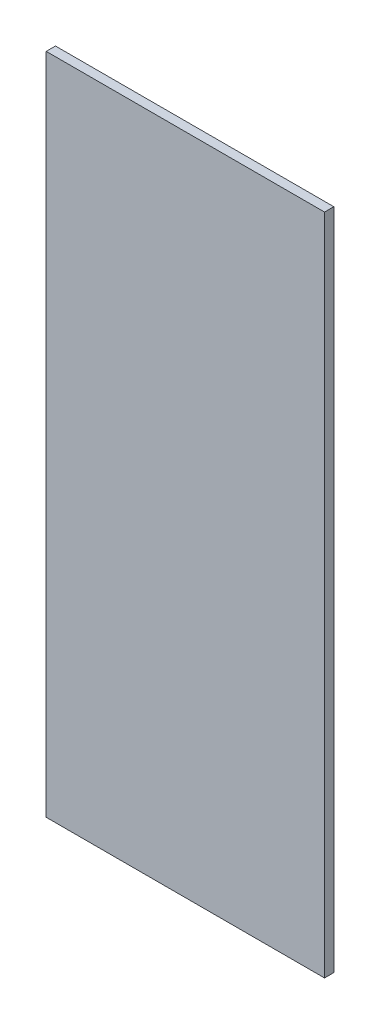
ISO-10303-21;
HEADER;
FILE_DESCRIPTION(('STEP AP214'),'2;1');
FILE_NAME('part.step','',(''),(''),'','','');
FILE_SCHEMA(('AUTOMOTIVE_DESIGN { 1 0 10303 214 1 1 1 1 }'));
ENDSEC;
DATA;
#1=APPLICATION_CONTEXT('core data for automotive mechanical design processes');
#2=APPLICATION_PROTOCOL_DEFINITION('international standard','automotive_design',2000,#1);
#3=PRODUCT_CONTEXT('',#1,'mechanical');
#4=PRODUCT('Part','Part','',(#3));
#5=PRODUCT_RELATED_PRODUCT_CATEGORY('part','',(#4));
#6=PRODUCT_DEFINITION_FORMATION('','',#4);
#7=PRODUCT_DEFINITION_CONTEXT('part definition',#1,'design');
#8=PRODUCT_DEFINITION('design','',#6,#7);
#9=PRODUCT_DEFINITION_SHAPE('','',#8);
#10=(LENGTH_UNIT() NAMED_UNIT(*) SI_UNIT(.MILLI.,.METRE.));
#11=(NAMED_UNIT(*) PLANE_ANGLE_UNIT() SI_UNIT($,.RADIAN.));
#12=(NAMED_UNIT(*) SI_UNIT($,.STERADIAN.) SOLID_ANGLE_UNIT());
#13=UNCERTAINTY_MEASURE_WITH_UNIT(LENGTH_MEASURE(1.E-05),#10,'distance_accuracy_value','');
#14=(GEOMETRIC_REPRESENTATION_CONTEXT(3) GLOBAL_UNCERTAINTY_ASSIGNED_CONTEXT((#13)) GLOBAL_UNIT_ASSIGNED_CONTEXT((#10,
#11,#12)) REPRESENTATION_CONTEXT('',''));
#15=CARTESIAN_POINT('',(0.,0.,0.));
#16=DIRECTION('',(0.,0.,1.));
#17=DIRECTION('',(1.,0.,0.));
#18=AXIS2_PLACEMENT_3D('',#15,#16,#17);
#19=CARTESIAN_POINT('',(30.,-71.5,-2.));
#20=DIRECTION('',(1.,0.,0.));
#21=DIRECTION('',(0.,0.,-1.));
#22=AXIS2_PLACEMENT_3D('',#19,#20,#21);
#23=PLANE('',#22);
#24=DIRECTION('',(0.,1.,0.));
#25=VECTOR('',#24,1.);
#26=CARTESIAN_POINT('',(30.,-71.5,0.));
#27=LINE('',#26,#25);
#28=CARTESIAN_POINT('',(30.,-71.5,0.));
#29=VERTEX_POINT('',#28);
#30=CARTESIAN_POINT('',(30.,71.5,0.));
#31=VERTEX_POINT('',#30);
#32=EDGE_CURVE('E99',#29,#31,#27,.T.);
#33=ORIENTED_EDGE('',*,*,#32,.F.);
#34=DIRECTION('',(0.,0.,1.));
#35=VECTOR('',#34,1.);
#36=CARTESIAN_POINT('',(30.,-71.5,-2.));
#37=LINE('',#36,#35);
#38=CARTESIAN_POINT('',(30.,-71.5,-2.));
#39=VERTEX_POINT('',#38);
#40=EDGE_CURVE('E11',#39,#29,#37,.T.);
#41=ORIENTED_EDGE('',*,*,#40,.F.);
#42=DIRECTION('',(0.,1.,0.));
#43=VECTOR('',#42,1.);
#44=CARTESIAN_POINT('',(30.,-71.5,-2.));
#45=LINE('',#44,#43);
#46=CARTESIAN_POINT('',(30.,71.5,-2.));
#47=VERTEX_POINT('',#46);
#48=EDGE_CURVE('E93',#39,#47,#45,.T.);
#49=ORIENTED_EDGE('',*,*,#48,.T.);
#50=DIRECTION('',(0.,0.,1.));
#51=VECTOR('',#50,1.);
#52=CARTESIAN_POINT('',(30.,71.5,-2.));
#53=LINE('',#52,#51);
#54=EDGE_CURVE('E38',#47,#31,#53,.T.);
#55=ORIENTED_EDGE('',*,*,#54,.T.);
#56=EDGE_LOOP('',(#33,#41,#49,#55));
#57=FACE_BOUND('',#56,.T.);
#58=ADVANCED_FACE('F35',(#57),#23,.T.);
#59=CARTESIAN_POINT('',(-30.,-71.5,-2.));
#60=DIRECTION('',(0.,-1.,0.));
#61=DIRECTION('',(0.,0.,-1.));
#62=AXIS2_PLACEMENT_3D('',#59,#60,#61);
#63=PLANE('',#62);
#64=DIRECTION('',(1.,0.,0.));
#65=VECTOR('',#64,1.);
#66=CARTESIAN_POINT('',(-30.,-71.5,0.));
#67=LINE('',#66,#65);
#68=CARTESIAN_POINT('',(-30.,-71.5,0.));
#69=VERTEX_POINT('',#68);
#70=EDGE_CURVE('E95',#69,#29,#67,.T.);
#71=ORIENTED_EDGE('',*,*,#70,.F.);
#72=DIRECTION('',(0.,0.,1.));
#73=VECTOR('',#72,1.);
#74=CARTESIAN_POINT('',(-30.,-71.5,-2.));
#75=LINE('',#74,#73);
#76=CARTESIAN_POINT('',(-30.,-71.5,-2.));
#77=VERTEX_POINT('',#76);
#78=EDGE_CURVE('E44',#77,#69,#75,.T.);
#79=ORIENTED_EDGE('',*,*,#78,.F.);
#80=DIRECTION('',(1.,0.,0.));
#81=VECTOR('',#80,1.);
#82=CARTESIAN_POINT('',(-30.,-71.5,-2.));
#83=LINE('',#82,#81);
#84=EDGE_CURVE('E90',#77,#39,#83,.T.);
#85=ORIENTED_EDGE('',*,*,#84,.T.);
#86=ORIENTED_EDGE('',*,*,#40,.T.);
#87=EDGE_LOOP('',(#71,#79,#85,#86));
#88=FACE_BOUND('',#87,.T.);
#89=ADVANCED_FACE('F109',(#88),#63,.T.);
#90=CARTESIAN_POINT('',(-30.,-71.5,-2.));
#91=DIRECTION('',(-1.,0.,0.));
#92=DIRECTION('',(0.,0.,1.));
#93=AXIS2_PLACEMENT_3D('',#90,#91,#92);
#94=PLANE('',#93);
#95=DIRECTION('',(0.,-1.,0.));
#96=VECTOR('',#95,1.);
#97=CARTESIAN_POINT('',(-30.,-71.5,0.));
#98=LINE('',#97,#96);
#99=CARTESIAN_POINT('',(-30.,71.5,0.));
#100=VERTEX_POINT('',#99);
#101=EDGE_CURVE('E85',#100,#69,#98,.T.);
#102=ORIENTED_EDGE('',*,*,#101,.F.);
#103=DIRECTION('',(0.,0.,1.));
#104=VECTOR('',#103,1.);
#105=CARTESIAN_POINT('',(-30.,71.5,-2.));
#106=LINE('',#105,#104);
#107=CARTESIAN_POINT('',(-30.,71.5,-2.));
#108=VERTEX_POINT('',#107);
#109=EDGE_CURVE('E80',#108,#100,#106,.T.);
#110=ORIENTED_EDGE('',*,*,#109,.F.);
#111=DIRECTION('',(0.,-1.,0.));
#112=VECTOR('',#111,1.);
#113=CARTESIAN_POINT('',(-30.,-71.5,-2.));
#114=LINE('',#113,#112);
#115=EDGE_CURVE('E83',#108,#77,#114,.T.);
#116=ORIENTED_EDGE('',*,*,#115,.T.);
#117=ORIENTED_EDGE('',*,*,#78,.T.);
#118=EDGE_LOOP('',(#102,#110,#116,#117));
#119=FACE_BOUND('',#118,.T.);
#120=ADVANCED_FACE('F82',(#119),#94,.T.);
#121=CARTESIAN_POINT('',(-30.,71.5,-2.));
#122=DIRECTION('',(0.,1.,0.));
#123=DIRECTION('',(0.,0.,1.));
#124=AXIS2_PLACEMENT_3D('',#121,#122,#123);
#125=PLANE('',#124);
#126=DIRECTION('',(-1.,0.,0.));
#127=VECTOR('',#126,1.);
#128=CARTESIAN_POINT('',(-30.,71.5,0.));
#129=LINE('',#128,#127);
#130=EDGE_CURVE('E102',#31,#100,#129,.T.);
#131=ORIENTED_EDGE('',*,*,#130,.F.);
#132=ORIENTED_EDGE('',*,*,#54,.F.);
#133=DIRECTION('',(-1.,0.,0.));
#134=VECTOR('',#133,1.);
#135=CARTESIAN_POINT('',(-30.,71.5,-2.));
#136=LINE('',#135,#134);
#137=EDGE_CURVE('E89',#47,#108,#136,.T.);
#138=ORIENTED_EDGE('',*,*,#137,.T.);
#139=ORIENTED_EDGE('',*,*,#109,.T.);
#140=EDGE_LOOP('',(#131,#132,#138,#139));
#141=FACE_BOUND('',#140,.T.);
#142=ADVANCED_FACE('F92',(#141),#125,.T.);
#143=CARTESIAN_POINT('',(0.,0.,-2.));
#144=DIRECTION('',(0.,0.,-1.));
#145=DIRECTION('',(-1.,0.,0.));
#146=AXIS2_PLACEMENT_3D('',#143,#144,#145);
#147=PLANE('',#146);
#148=ORIENTED_EDGE('',*,*,#48,.F.);
#149=ORIENTED_EDGE('',*,*,#84,.F.);
#150=ORIENTED_EDGE('',*,*,#115,.F.);
#151=ORIENTED_EDGE('',*,*,#137,.F.);
#152=EDGE_LOOP('',(#148,#149,#150,#151));
#153=FACE_BOUND('',#152,.T.);
#154=ADVANCED_FACE('F88',(#153),#147,.T.);
#155=CARTESIAN_POINT('',(0.,0.,0.));
#156=DIRECTION('',(0.,0.,-1.));
#157=DIRECTION('',(-1.,0.,0.));
#158=AXIS2_PLACEMENT_3D('',#155,#156,#157);
#159=PLANE('',#158);
#160=ORIENTED_EDGE('',*,*,#32,.T.);
#161=ORIENTED_EDGE('',*,*,#130,.T.);
#162=ORIENTED_EDGE('',*,*,#101,.T.);
#163=ORIENTED_EDGE('',*,*,#70,.T.);
#164=EDGE_LOOP('',(#160,#161,#162,#163));
#165=FACE_BOUND('',#164,.T.);
#166=ADVANCED_FACE('F108',(#165),#159,.F.);
#167=CLOSED_SHELL('',(#58,#89,#120,#142,#154,#166));
#168=MANIFOLD_SOLID_BREP('B2',#167);
#169=ADVANCED_BREP_SHAPE_REPRESENTATION('',(#18,#168),#14);
#170=SHAPE_DEFINITION_REPRESENTATION(#9,#169);
ENDSEC;
END-ISO-10303-21;
